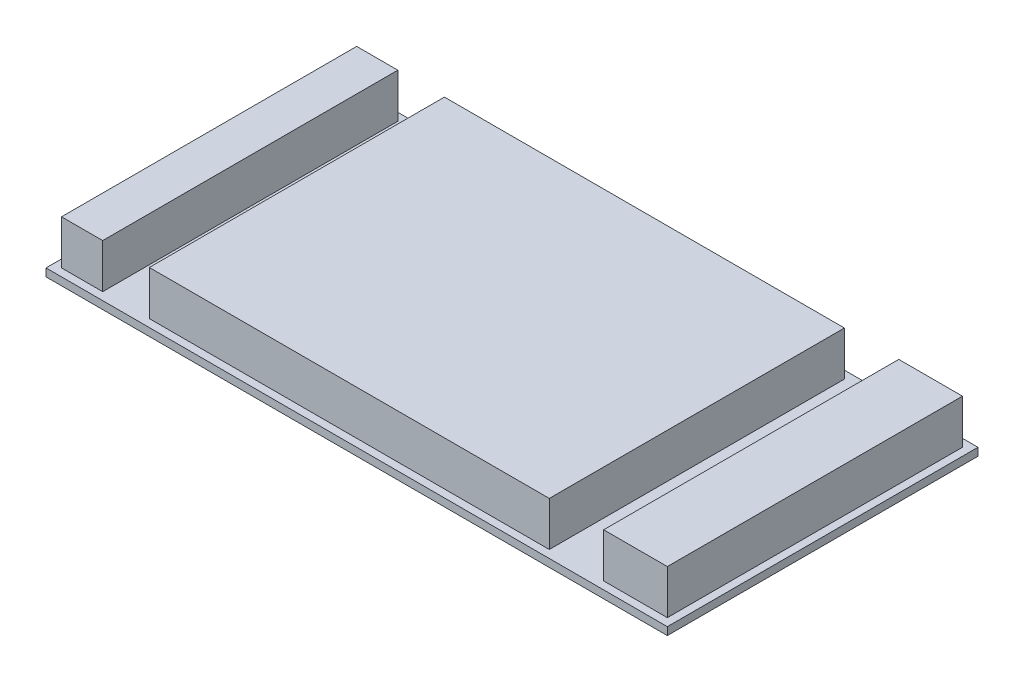
ISO-10303-21;
HEADER;
FILE_DESCRIPTION(('STEP AP214'),'2;1');
FILE_NAME('part.step','',(''),(''),'','','');
FILE_SCHEMA(('AUTOMOTIVE_DESIGN { 1 0 10303 214 1 1 1 1 }'));
ENDSEC;
DATA;
#1=APPLICATION_CONTEXT('core data for automotive mechanical design processes');
#2=APPLICATION_PROTOCOL_DEFINITION('international standard','automotive_design',2000,#1);
#3=PRODUCT_CONTEXT('',#1,'mechanical');
#4=PRODUCT('Part','Part','',(#3));
#5=PRODUCT_RELATED_PRODUCT_CATEGORY('part','',(#4));
#6=PRODUCT_DEFINITION_FORMATION('','',#4);
#7=PRODUCT_DEFINITION_CONTEXT('part definition',#1,'design');
#8=PRODUCT_DEFINITION('design','',#6,#7);
#9=PRODUCT_DEFINITION_SHAPE('','',#8);
#10=(LENGTH_UNIT() NAMED_UNIT(*) SI_UNIT(.MILLI.,.METRE.));
#11=(NAMED_UNIT(*) PLANE_ANGLE_UNIT() SI_UNIT($,.RADIAN.));
#12=(NAMED_UNIT(*) SI_UNIT($,.STERADIAN.) SOLID_ANGLE_UNIT());
#13=UNCERTAINTY_MEASURE_WITH_UNIT(LENGTH_MEASURE(1.E-05),#10,'distance_accuracy_value','');
#14=(GEOMETRIC_REPRESENTATION_CONTEXT(3) GLOBAL_UNCERTAINTY_ASSIGNED_CONTEXT((#13)) GLOBAL_UNIT_ASSIGNED_CONTEXT((#10,
#11,#12)) REPRESENTATION_CONTEXT('',''));
#15=CARTESIAN_POINT('',(0.,0.,0.));
#16=DIRECTION('',(0.,0.,1.));
#17=DIRECTION('',(1.,0.,0.));
#18=AXIS2_PLACEMENT_3D('',#15,#16,#17);
#19=CARTESIAN_POINT('',(80.8789473684211,17.018,-23.1273684210526));
#20=DIRECTION('',(0.,0.,1.));
#21=DIRECTION('',(1.,0.,0.));
#22=AXIS2_PLACEMENT_3D('',#19,#20,#21);
#23=PLANE('',#22);
#24=DIRECTION('',(-1.,0.,0.));
#25=VECTOR('',#24,1.);
#26=CARTESIAN_POINT('',(80.8789473684211,17.018,-23.1273684210526));
#27=LINE('',#26,#25);
#28=CARTESIAN_POINT('',(42.2709473684211,17.018,-23.1273684210526));
#29=VERTEX_POINT('',#28);
#30=CARTESIAN_POINT('',(-88.5390526315789,17.018,-23.1273684210526));
#31=VERTEX_POINT('',#30);
#32=EDGE_CURVE('E175',#29,#31,#27,.T.);
#33=ORIENTED_EDGE('',*,*,#32,.F.);
#34=DIRECTION('',(0.,1.,0.));
#35=VECTOR('',#34,1.);
#36=CARTESIAN_POINT('',(42.2709473684211,17.018,-23.1273684210526));
#37=LINE('',#36,#35);
#38=CARTESIAN_POINT('',(42.2709473684211,2.54,-23.1273684210526));
#39=VERTEX_POINT('',#38);
#40=EDGE_CURVE('E166',#39,#29,#37,.T.);
#41=ORIENTED_EDGE('',*,*,#40,.F.);
#42=DIRECTION('',(-1.,0.,0.));
#43=VECTOR('',#42,1.);
#44=CARTESIAN_POINT('',(80.8789473684211,2.54,-23.1273684210526));
#45=LINE('',#44,#43);
#46=CARTESIAN_POINT('',(-88.5390526315789,2.54,-23.1273684210526));
#47=VERTEX_POINT('',#46);
#48=EDGE_CURVE('E383',#39,#47,#45,.T.);
#49=ORIENTED_EDGE('',*,*,#48,.T.);
#50=DIRECTION('',(0.,-1.,0.));
#51=VECTOR('',#50,1.);
#52=CARTESIAN_POINT('',(-88.5390526315789,17.018,-23.1273684210526));
#53=LINE('',#52,#51);
#54=EDGE_CURVE('E395',#31,#47,#53,.T.);
#55=ORIENTED_EDGE('',*,*,#54,.F.);
#56=EDGE_LOOP('',(#33,#41,#49,#55));
#57=FACE_BOUND('',#56,.T.);
#58=ADVANCED_FACE('F39',(#57),#23,.F.);
#59=CARTESIAN_POINT('',(-103.779052631579,17.018,-23.1273684210526));
#60=VERTEX_POINT('',#59);
#61=CARTESIAN_POINT('',(-117.241052631579,17.018,-23.1273684210526));
#62=VERTEX_POINT('',#61);
#63=EDGE_CURVE('E177',#60,#62,#27,.T.);
#64=ORIENTED_EDGE('',*,*,#63,.F.);
#65=DIRECTION('',(0.,1.,0.));
#66=VECTOR('',#65,1.);
#67=CARTESIAN_POINT('',(-103.779052631579,17.018,-23.1273684210526));
#68=LINE('',#67,#66);
#69=CARTESIAN_POINT('',(-103.779052631579,2.54,-23.1273684210526));
#70=VERTEX_POINT('',#69);
#71=EDGE_CURVE('E270',#70,#60,#68,.T.);
#72=ORIENTED_EDGE('',*,*,#71,.F.);
#73=CARTESIAN_POINT('',(-117.241052631579,2.54,-23.1273684210526));
#74=VERTEX_POINT('',#73);
#75=EDGE_CURVE('E365',#70,#74,#45,.T.);
#76=ORIENTED_EDGE('',*,*,#75,.T.);
#77=DIRECTION('',(0.,-1.,0.));
#78=VECTOR('',#77,1.);
#79=CARTESIAN_POINT('',(-117.241052631579,17.018,-23.1273684210526));
#80=LINE('',#79,#78);
#81=EDGE_CURVE('E214',#62,#74,#80,.T.);
#82=ORIENTED_EDGE('',*,*,#81,.F.);
#83=EDGE_LOOP('',(#64,#72,#76,#82));
#84=FACE_BOUND('',#83,.T.);
#85=ADVANCED_FACE('F305',(#84),#23,.F.);
#86=CARTESIAN_POINT('',(-117.241052631579,17.018,73.3926315789474));
#87=DIRECTION('',(0.,0.,-1.));
#88=DIRECTION('',(-1.,0.,0.));
#89=AXIS2_PLACEMENT_3D('',#86,#87,#88);
#90=PLANE('',#89);
#91=DIRECTION('',(1.,0.,0.));
#92=VECTOR('',#91,1.);
#93=CARTESIAN_POINT('',(-117.241052631579,2.54,73.3926315789474));
#94=LINE('',#93,#92);
#95=CARTESIAN_POINT('',(-88.5390526315789,2.54,73.3926315789474));
#96=VERTEX_POINT('',#95);
#97=CARTESIAN_POINT('',(42.2709473684211,2.54,73.3926315789474));
#98=VERTEX_POINT('',#97);
#99=EDGE_CURVE('E199',#96,#98,#94,.T.);
#100=ORIENTED_EDGE('',*,*,#99,.T.);
#101=DIRECTION('',(0.,1.,0.));
#102=VECTOR('',#101,1.);
#103=CARTESIAN_POINT('',(42.2709473684211,17.018,73.3926315789474));
#104=LINE('',#103,#102);
#105=CARTESIAN_POINT('',(42.2709473684211,17.018,73.3926315789474));
#106=VERTEX_POINT('',#105);
#107=EDGE_CURVE('E377',#98,#106,#104,.T.);
#108=ORIENTED_EDGE('',*,*,#107,.T.);
#109=DIRECTION('',(1.,0.,0.));
#110=VECTOR('',#109,1.);
#111=CARTESIAN_POINT('',(-117.241052631579,17.018,73.3926315789474));
#112=LINE('',#111,#110);
#113=CARTESIAN_POINT('',(-88.5390526315789,17.018,73.3926315789474));
#114=VERTEX_POINT('',#113);
#115=EDGE_CURVE('E281',#114,#106,#112,.T.);
#116=ORIENTED_EDGE('',*,*,#115,.F.);
#117=DIRECTION('',(0.,-1.,0.));
#118=VECTOR('',#117,1.);
#119=CARTESIAN_POINT('',(-88.5390526315789,17.018,73.3926315789474));
#120=LINE('',#119,#118);
#121=EDGE_CURVE('E63',#114,#96,#120,.T.);
#122=ORIENTED_EDGE('',*,*,#121,.T.);
#123=EDGE_LOOP('',(#100,#108,#116,#122));
#124=FACE_BOUND('',#123,.T.);
#125=ADVANCED_FACE('F303',(#124),#90,.F.);
#126=CARTESIAN_POINT('',(-117.241052631579,2.54,73.3926315789474));
#127=VERTEX_POINT('',#126);
#128=CARTESIAN_POINT('',(-103.779052631579,2.54,73.3926315789474));
#129=VERTEX_POINT('',#128);
#130=EDGE_CURVE('E192',#127,#129,#94,.T.);
#131=ORIENTED_EDGE('',*,*,#130,.T.);
#132=DIRECTION('',(0.,1.,0.));
#133=VECTOR('',#132,1.);
#134=CARTESIAN_POINT('',(-103.779052631579,17.018,73.3926315789474));
#135=LINE('',#134,#133);
#136=CARTESIAN_POINT('',(-103.779052631579,17.018,73.3926315789474));
#137=VERTEX_POINT('',#136);
#138=EDGE_CURVE('E267',#129,#137,#135,.T.);
#139=ORIENTED_EDGE('',*,*,#138,.T.);
#140=CARTESIAN_POINT('',(-117.241052631579,17.018,73.3926315789474));
#141=VERTEX_POINT('',#140);
#142=EDGE_CURVE('E275',#141,#137,#112,.T.);
#143=ORIENTED_EDGE('',*,*,#142,.F.);
#144=DIRECTION('',(0.,-1.,0.));
#145=VECTOR('',#144,1.);
#146=CARTESIAN_POINT('',(-117.241052631579,17.018,73.3926315789474));
#147=LINE('',#146,#145);
#148=EDGE_CURVE('E210',#141,#127,#147,.T.);
#149=ORIENTED_EDGE('',*,*,#148,.T.);
#150=EDGE_LOOP('',(#131,#139,#143,#149));
#151=FACE_BOUND('',#150,.T.);
#152=ADVANCED_FACE('F274',(#151),#90,.F.);
#153=CARTESIAN_POINT('',(0.,17.018,0.));
#154=DIRECTION('',(0.,1.,0.));
#155=DIRECTION('',(0.,0.,1.));
#156=AXIS2_PLACEMENT_3D('',#153,#154,#155);
#157=PLANE('',#156);
#158=DIRECTION('',(0.,0.,1.));
#159=VECTOR('',#158,1.);
#160=CARTESIAN_POINT('',(42.2709473684211,17.018,0.));
#161=LINE('',#160,#159);
#162=EDGE_CURVE('E11',#29,#106,#161,.T.);
#163=ORIENTED_EDGE('',*,*,#162,.F.);
#164=ORIENTED_EDGE('',*,*,#32,.T.);
#165=DIRECTION('',(0.,0.,-1.));
#166=VECTOR('',#165,1.);
#167=CARTESIAN_POINT('',(-88.5390526315789,17.018,0.));
#168=LINE('',#167,#166);
#169=EDGE_CURVE('E260',#114,#31,#168,.T.);
#170=ORIENTED_EDGE('',*,*,#169,.F.);
#171=ORIENTED_EDGE('',*,*,#115,.T.);
#172=EDGE_LOOP('',(#163,#164,#170,#171));
#173=FACE_BOUND('',#172,.T.);
#174=ADVANCED_FACE('F300',(#173),#157,.T.);
#175=DIRECTION('',(0.,0.,1.));
#176=VECTOR('',#175,1.);
#177=CARTESIAN_POINT('',(-103.779052631579,17.018,0.));
#178=LINE('',#177,#176);
#179=EDGE_CURVE('E158',#60,#137,#178,.T.);
#180=ORIENTED_EDGE('',*,*,#179,.F.);
#181=ORIENTED_EDGE('',*,*,#63,.T.);
#182=DIRECTION('',(0.,0.,1.));
#183=VECTOR('',#182,1.);
#184=CARTESIAN_POINT('',(-117.241052631579,17.018,-23.1273684210526));
#185=LINE('',#184,#183);
#186=EDGE_CURVE('E174',#62,#141,#185,.T.);
#187=ORIENTED_EDGE('',*,*,#186,.T.);
#188=ORIENTED_EDGE('',*,*,#142,.T.);
#189=EDGE_LOOP('',(#180,#181,#187,#188));
#190=FACE_BOUND('',#189,.T.);
#191=ADVANCED_FACE('F278',(#190),#157,.T.);
#192=CARTESIAN_POINT('',(-119.781052631579,2.54,-25.6673684210526));
#193=DIRECTION('',(1.,0.,0.));
#194=DIRECTION('',(0.,0.,-1.));
#195=AXIS2_PLACEMENT_3D('',#192,#193,#194);
#196=PLANE('',#195);
#197=DIRECTION('',(0.,0.,1.));
#198=VECTOR('',#197,1.);
#199=CARTESIAN_POINT('',(-119.781052631579,0.,-25.6673684210526));
#200=LINE('',#199,#198);
#201=CARTESIAN_POINT('',(-119.781052631579,0.,-25.6673684210526));
#202=VERTEX_POINT('',#201);
#203=CARTESIAN_POINT('',(-119.781052631579,0.,75.9326315789474));
#204=VERTEX_POINT('',#203);
#205=EDGE_CURVE('E218',#202,#204,#200,.T.);
#206=ORIENTED_EDGE('',*,*,#205,.T.);
#207=DIRECTION('',(0.,-1.,0.));
#208=VECTOR('',#207,1.);
#209=CARTESIAN_POINT('',(-119.781052631579,2.54,75.9326315789474));
#210=LINE('',#209,#208);
#211=CARTESIAN_POINT('',(-119.781052631579,2.54,75.9326315789474));
#212=VERTEX_POINT('',#211);
#213=EDGE_CURVE('E256',#212,#204,#210,.T.);
#214=ORIENTED_EDGE('',*,*,#213,.F.);
#215=DIRECTION('',(0.,0.,1.));
#216=VECTOR('',#215,1.);
#217=CARTESIAN_POINT('',(-119.781052631579,2.54,-25.6673684210526));
#218=LINE('',#217,#216);
#219=CARTESIAN_POINT('',(-119.781052631579,2.54,-25.6673684210526));
#220=VERTEX_POINT('',#219);
#221=EDGE_CURVE('E219',#220,#212,#218,.T.);
#222=ORIENTED_EDGE('',*,*,#221,.F.);
#223=DIRECTION('',(0.,-1.,0.));
#224=VECTOR('',#223,1.);
#225=CARTESIAN_POINT('',(-119.781052631579,2.54,-25.6673684210526));
#226=LINE('',#225,#224);
#227=EDGE_CURVE('E233',#220,#202,#226,.T.);
#228=ORIENTED_EDGE('',*,*,#227,.T.);
#229=EDGE_LOOP('',(#206,#214,#222,#228));
#230=FACE_BOUND('',#229,.T.);
#231=ADVANCED_FACE('F41',(#230),#196,.F.);
#232=CARTESIAN_POINT('',(-119.781052631579,2.54,75.9326315789474));
#233=DIRECTION('',(0.,0.,-1.));
#234=DIRECTION('',(-1.,0.,0.));
#235=AXIS2_PLACEMENT_3D('',#232,#233,#234);
#236=PLANE('',#235);
#237=DIRECTION('',(1.,0.,0.));
#238=VECTOR('',#237,1.);
#239=CARTESIAN_POINT('',(-119.781052631579,0.,75.9326315789474));
#240=LINE('',#239,#238);
#241=CARTESIAN_POINT('',(83.4189473684211,0.,75.9326315789474));
#242=VERTEX_POINT('',#241);
#243=EDGE_CURVE('E237',#204,#242,#240,.T.);
#244=ORIENTED_EDGE('',*,*,#243,.T.);
#245=DIRECTION('',(0.,-1.,0.));
#246=VECTOR('',#245,1.);
#247=CARTESIAN_POINT('',(83.4189473684211,2.54,75.9326315789474));
#248=LINE('',#247,#246);
#249=CARTESIAN_POINT('',(83.4189473684211,2.54,75.9326315789474));
#250=VERTEX_POINT('',#249);
#251=EDGE_CURVE('E252',#250,#242,#248,.T.);
#252=ORIENTED_EDGE('',*,*,#251,.F.);
#253=DIRECTION('',(1.,0.,0.));
#254=VECTOR('',#253,1.);
#255=CARTESIAN_POINT('',(-119.781052631579,2.54,75.9326315789474));
#256=LINE('',#255,#254);
#257=EDGE_CURVE('E223',#212,#250,#256,.T.);
#258=ORIENTED_EDGE('',*,*,#257,.F.);
#259=ORIENTED_EDGE('',*,*,#213,.T.);
#260=EDGE_LOOP('',(#244,#252,#258,#259));
#261=FACE_BOUND('',#260,.T.);
#262=ADVANCED_FACE('F337',(#261),#236,.F.);
#263=CARTESIAN_POINT('',(83.4189473684211,2.54,-25.6673684210526));
#264=DIRECTION('',(-1.,0.,0.));
#265=DIRECTION('',(0.,0.,1.));
#266=AXIS2_PLACEMENT_3D('',#263,#264,#265);
#267=PLANE('',#266);
#268=DIRECTION('',(0.,0.,-1.));
#269=VECTOR('',#268,1.);
#270=CARTESIAN_POINT('',(83.4189473684211,0.,-25.6673684210526));
#271=LINE('',#270,#269);
#272=CARTESIAN_POINT('',(83.4189473684211,0.,-25.6673684210526));
#273=VERTEX_POINT('',#272);
#274=EDGE_CURVE('E240',#242,#273,#271,.T.);
#275=ORIENTED_EDGE('',*,*,#274,.T.);
#276=DIRECTION('',(0.,-1.,0.));
#277=VECTOR('',#276,1.);
#278=CARTESIAN_POINT('',(83.4189473684211,2.54,-25.6673684210526));
#279=LINE('',#278,#277);
#280=CARTESIAN_POINT('',(83.4189473684211,2.54,-25.6673684210526));
#281=VERTEX_POINT('',#280);
#282=EDGE_CURVE('E248',#281,#273,#279,.T.);
#283=ORIENTED_EDGE('',*,*,#282,.F.);
#284=DIRECTION('',(0.,0.,-1.));
#285=VECTOR('',#284,1.);
#286=CARTESIAN_POINT('',(83.4189473684211,2.54,-25.6673684210526));
#287=LINE('',#286,#285);
#288=EDGE_CURVE('E227',#250,#281,#287,.T.);
#289=ORIENTED_EDGE('',*,*,#288,.F.);
#290=ORIENTED_EDGE('',*,*,#251,.T.);
#291=EDGE_LOOP('',(#275,#283,#289,#290));
#292=FACE_BOUND('',#291,.T.);
#293=ADVANCED_FACE('F334',(#292),#267,.F.);
#294=CARTESIAN_POINT('',(-119.781052631579,2.54,-25.6673684210526));
#295=DIRECTION('',(0.,0.,1.));
#296=DIRECTION('',(1.,0.,0.));
#297=AXIS2_PLACEMENT_3D('',#294,#295,#296);
#298=PLANE('',#297);
#299=DIRECTION('',(-1.,0.,0.));
#300=VECTOR('',#299,1.);
#301=CARTESIAN_POINT('',(-119.781052631579,0.,-25.6673684210526));
#302=LINE('',#301,#300);
#303=EDGE_CURVE('E224',#273,#202,#302,.T.);
#304=ORIENTED_EDGE('',*,*,#303,.T.);
#305=ORIENTED_EDGE('',*,*,#227,.F.);
#306=DIRECTION('',(-1.,0.,0.));
#307=VECTOR('',#306,1.);
#308=CARTESIAN_POINT('',(-119.781052631579,2.54,-25.6673684210526));
#309=LINE('',#308,#307);
#310=EDGE_CURVE('E230',#281,#220,#309,.T.);
#311=ORIENTED_EDGE('',*,*,#310,.F.);
#312=ORIENTED_EDGE('',*,*,#282,.T.);
#313=EDGE_LOOP('',(#304,#305,#311,#312));
#314=FACE_BOUND('',#313,.T.);
#315=ADVANCED_FACE('F328',(#314),#298,.F.);
#316=CARTESIAN_POINT('',(0.,2.54,0.));
#317=DIRECTION('',(0.,1.,0.));
#318=DIRECTION('',(0.,0.,1.));
#319=AXIS2_PLACEMENT_3D('',#316,#317,#318);
#320=PLANE('',#319);
#321=ORIENTED_EDGE('',*,*,#257,.T.);
#322=ORIENTED_EDGE('',*,*,#288,.T.);
#323=ORIENTED_EDGE('',*,*,#310,.T.);
#324=ORIENTED_EDGE('',*,*,#221,.T.);
#325=EDGE_LOOP('',(#321,#322,#323,#324));
#326=FACE_BOUND('',#325,.T.);
#327=CARTESIAN_POINT('',(60.0509473684211,2.54,73.3926315789474));
#328=VERTEX_POINT('',#327);
#329=CARTESIAN_POINT('',(80.8789473684211,2.54,73.3926315789474));
#330=VERTEX_POINT('',#329);
#331=EDGE_CURVE('E201',#328,#330,#94,.T.);
#332=ORIENTED_EDGE('',*,*,#331,.F.);
#333=DIRECTION('',(0.,0.,-1.));
#334=VECTOR('',#333,1.);
#335=CARTESIAN_POINT('',(60.0509473684211,2.54,78.4726315789474));
#336=LINE('',#335,#334);
#337=CARTESIAN_POINT('',(60.0509473684211,2.54,-23.1273684210526));
#338=VERTEX_POINT('',#337);
#339=EDGE_CURVE('E402',#328,#338,#336,.T.);
#340=ORIENTED_EDGE('',*,*,#339,.T.);
#341=CARTESIAN_POINT('',(80.8789473684211,2.54,-23.1273684210526));
#342=VERTEX_POINT('',#341);
#343=EDGE_CURVE('E164',#342,#338,#45,.T.);
#344=ORIENTED_EDGE('',*,*,#343,.F.);
#345=DIRECTION('',(0.,0.,-1.));
#346=VECTOR('',#345,1.);
#347=CARTESIAN_POINT('',(80.8789473684211,2.54,73.3926315789474));
#348=LINE('',#347,#346);
#349=EDGE_CURVE('E185',#330,#342,#348,.T.);
#350=ORIENTED_EDGE('',*,*,#349,.F.);
#351=EDGE_LOOP('',(#332,#340,#344,#350));
#352=FACE_BOUND('',#351,.T.);
#353=DIRECTION('',(0.,0.,-1.));
#354=VECTOR('',#353,1.);
#355=CARTESIAN_POINT('',(42.2709473684211,2.54,78.4726315789474));
#356=LINE('',#355,#354);
#357=EDGE_CURVE('E360',#98,#39,#356,.T.);
#358=ORIENTED_EDGE('',*,*,#357,.F.);
#359=ORIENTED_EDGE('',*,*,#99,.F.);
#360=DIRECTION('',(0.,0.,-1.));
#361=VECTOR('',#360,1.);
#362=CARTESIAN_POINT('',(-88.5390526315789,2.54,78.4726315789474));
#363=LINE('',#362,#361);
#364=EDGE_CURVE('E367',#96,#47,#363,.T.);
#365=ORIENTED_EDGE('',*,*,#364,.T.);
#366=ORIENTED_EDGE('',*,*,#48,.F.);
#367=EDGE_LOOP('',(#358,#359,#365,#366));
#368=FACE_BOUND('',#367,.T.);
#369=DIRECTION('',(0.,0.,-1.));
#370=VECTOR('',#369,1.);
#371=CARTESIAN_POINT('',(-103.779052631579,2.54,78.4726315789474));
#372=LINE('',#371,#370);
#373=EDGE_CURVE('E167',#129,#70,#372,.T.);
#374=ORIENTED_EDGE('',*,*,#373,.F.);
#375=ORIENTED_EDGE('',*,*,#130,.F.);
#376=DIRECTION('',(0.,0.,1.));
#377=VECTOR('',#376,1.);
#378=CARTESIAN_POINT('',(-117.241052631579,2.54,-23.1273684210526));
#379=LINE('',#378,#377);
#380=EDGE_CURVE('E389',#74,#127,#379,.T.);
#381=ORIENTED_EDGE('',*,*,#380,.F.);
#382=ORIENTED_EDGE('',*,*,#75,.F.);
#383=EDGE_LOOP('',(#374,#375,#381,#382));
#384=FACE_BOUND('',#383,.T.);
#385=ADVANCED_FACE('F322',(#326,#352,#368,#384),#320,.T.);
#386=CARTESIAN_POINT('',(0.,0.,0.));
#387=DIRECTION('',(0.,1.,0.));
#388=DIRECTION('',(0.,0.,1.));
#389=AXIS2_PLACEMENT_3D('',#386,#387,#388);
#390=PLANE('',#389);
#391=ORIENTED_EDGE('',*,*,#205,.F.);
#392=ORIENTED_EDGE('',*,*,#303,.F.);
#393=ORIENTED_EDGE('',*,*,#274,.F.);
#394=ORIENTED_EDGE('',*,*,#243,.F.);
#395=EDGE_LOOP('',(#391,#392,#393,#394));
#396=FACE_BOUND('',#395,.T.);
#397=ADVANCED_FACE('F316',(#396),#390,.F.);
#398=ORIENTED_EDGE('',*,*,#343,.T.);
#399=DIRECTION('',(0.,-1.,0.));
#400=VECTOR('',#399,1.);
#401=CARTESIAN_POINT('',(60.0509473684211,17.018,-23.1273684210526));
#402=LINE('',#401,#400);
#403=CARTESIAN_POINT('',(60.0509473684211,17.018,-23.1273684210526));
#404=VERTEX_POINT('',#403);
#405=EDGE_CURVE('E152',#404,#338,#402,.T.);
#406=ORIENTED_EDGE('',*,*,#405,.F.);
#407=CARTESIAN_POINT('',(80.8789473684211,17.018,-23.1273684210526));
#408=VERTEX_POINT('',#407);
#409=EDGE_CURVE('E163',#408,#404,#27,.T.);
#410=ORIENTED_EDGE('',*,*,#409,.F.);
#411=DIRECTION('',(0.,-1.,0.));
#412=VECTOR('',#411,1.);
#413=CARTESIAN_POINT('',(80.8789473684211,17.018,-23.1273684210526));
#414=LINE('',#413,#412);
#415=EDGE_CURVE('E204',#408,#342,#414,.T.);
#416=ORIENTED_EDGE('',*,*,#415,.T.);
#417=EDGE_LOOP('',(#398,#406,#410,#416));
#418=FACE_BOUND('',#417,.T.);
#419=ADVANCED_FACE('F161',(#418),#23,.F.);
#420=CARTESIAN_POINT('',(-117.241052631579,17.018,-23.1273684210526));
#421=DIRECTION('',(1.,0.,0.));
#422=DIRECTION('',(0.,0.,-1.));
#423=AXIS2_PLACEMENT_3D('',#420,#421,#422);
#424=PLANE('',#423);
#425=ORIENTED_EDGE('',*,*,#380,.T.);
#426=ORIENTED_EDGE('',*,*,#148,.F.);
#427=ORIENTED_EDGE('',*,*,#186,.F.);
#428=ORIENTED_EDGE('',*,*,#81,.T.);
#429=EDGE_LOOP('',(#425,#426,#427,#428));
#430=FACE_BOUND('',#429,.T.);
#431=ADVANCED_FACE('F301',(#430),#424,.F.);
#432=CARTESIAN_POINT('',(60.0509473684211,17.018,73.3926315789474));
#433=VERTEX_POINT('',#432);
#434=CARTESIAN_POINT('',(80.8789473684211,17.018,73.3926315789474));
#435=VERTEX_POINT('',#434);
#436=EDGE_CURVE('E180',#433,#435,#112,.T.);
#437=ORIENTED_EDGE('',*,*,#436,.F.);
#438=DIRECTION('',(0.,-1.,0.));
#439=VECTOR('',#438,1.);
#440=CARTESIAN_POINT('',(60.0509473684211,17.018,73.3926315789474));
#441=LINE('',#440,#439);
#442=EDGE_CURVE('E55',#433,#328,#441,.T.);
#443=ORIENTED_EDGE('',*,*,#442,.T.);
#444=ORIENTED_EDGE('',*,*,#331,.T.);
#445=DIRECTION('',(0.,-1.,0.));
#446=VECTOR('',#445,1.);
#447=CARTESIAN_POINT('',(80.8789473684211,17.018,73.3926315789474));
#448=LINE('',#447,#446);
#449=EDGE_CURVE('E207',#435,#330,#448,.T.);
#450=ORIENTED_EDGE('',*,*,#449,.F.);
#451=EDGE_LOOP('',(#437,#443,#444,#450));
#452=FACE_BOUND('',#451,.T.);
#453=ADVANCED_FACE('F290',(#452),#90,.F.);
#454=CARTESIAN_POINT('',(80.8789473684211,17.018,73.3926315789474));
#455=DIRECTION('',(-1.,0.,0.));
#456=DIRECTION('',(0.,0.,1.));
#457=AXIS2_PLACEMENT_3D('',#454,#455,#456);
#458=PLANE('',#457);
#459=ORIENTED_EDGE('',*,*,#349,.T.);
#460=ORIENTED_EDGE('',*,*,#415,.F.);
#461=DIRECTION('',(0.,0.,-1.));
#462=VECTOR('',#461,1.);
#463=CARTESIAN_POINT('',(80.8789473684211,17.018,73.3926315789474));
#464=LINE('',#463,#462);
#465=EDGE_CURVE('E171',#435,#408,#464,.T.);
#466=ORIENTED_EDGE('',*,*,#465,.F.);
#467=ORIENTED_EDGE('',*,*,#449,.T.);
#468=EDGE_LOOP('',(#459,#460,#466,#467));
#469=FACE_BOUND('',#468,.T.);
#470=ADVANCED_FACE('F292',(#469),#458,.F.);
#471=DIRECTION('',(0.,0.,-1.));
#472=VECTOR('',#471,1.);
#473=CARTESIAN_POINT('',(60.0509473684211,17.018,0.));
#474=LINE('',#473,#472);
#475=EDGE_CURVE('E48',#433,#404,#474,.T.);
#476=ORIENTED_EDGE('',*,*,#475,.F.);
#477=ORIENTED_EDGE('',*,*,#436,.T.);
#478=ORIENTED_EDGE('',*,*,#465,.T.);
#479=ORIENTED_EDGE('',*,*,#409,.T.);
#480=EDGE_LOOP('',(#476,#477,#478,#479));
#481=FACE_BOUND('',#480,.T.);
#482=ADVANCED_FACE('F169',(#481),#157,.T.);
#483=CARTESIAN_POINT('',(-103.779052631579,17.018,78.4726315789474));
#484=DIRECTION('',(-1.,0.,0.));
#485=DIRECTION('',(0.,0.,1.));
#486=AXIS2_PLACEMENT_3D('',#483,#484,#485);
#487=PLANE('',#486);
#488=ORIENTED_EDGE('',*,*,#373,.T.);
#489=ORIENTED_EDGE('',*,*,#71,.T.);
#490=ORIENTED_EDGE('',*,*,#179,.T.);
#491=ORIENTED_EDGE('',*,*,#138,.F.);
#492=EDGE_LOOP('',(#488,#489,#490,#491));
#493=FACE_BOUND('',#492,.T.);
#494=ADVANCED_FACE('F266',(#493),#487,.F.);
#495=CARTESIAN_POINT('',(-88.5390526315789,17.018,78.4726315789474));
#496=DIRECTION('',(1.,0.,0.));
#497=DIRECTION('',(0.,0.,-1.));
#498=AXIS2_PLACEMENT_3D('',#495,#496,#497);
#499=PLANE('',#498);
#500=ORIENTED_EDGE('',*,*,#169,.T.);
#501=ORIENTED_EDGE('',*,*,#54,.T.);
#502=ORIENTED_EDGE('',*,*,#364,.F.);
#503=ORIENTED_EDGE('',*,*,#121,.F.);
#504=EDGE_LOOP('',(#500,#501,#502,#503));
#505=FACE_BOUND('',#504,.T.);
#506=ADVANCED_FACE('F396',(#505),#499,.F.);
#507=CARTESIAN_POINT('',(42.2709473684211,17.018,78.4726315789474));
#508=DIRECTION('',(-1.,0.,0.));
#509=DIRECTION('',(0.,0.,1.));
#510=AXIS2_PLACEMENT_3D('',#507,#508,#509);
#511=PLANE('',#510);
#512=ORIENTED_EDGE('',*,*,#357,.T.);
#513=ORIENTED_EDGE('',*,*,#40,.T.);
#514=ORIENTED_EDGE('',*,*,#162,.T.);
#515=ORIENTED_EDGE('',*,*,#107,.F.);
#516=EDGE_LOOP('',(#512,#513,#514,#515));
#517=FACE_BOUND('',#516,.T.);
#518=ADVANCED_FACE('F408',(#517),#511,.F.);
#519=CARTESIAN_POINT('',(60.0509473684211,17.018,78.4726315789474));
#520=DIRECTION('',(1.,0.,0.));
#521=DIRECTION('',(0.,0.,-1.));
#522=AXIS2_PLACEMENT_3D('',#519,#520,#521);
#523=PLANE('',#522);
#524=ORIENTED_EDGE('',*,*,#475,.T.);
#525=ORIENTED_EDGE('',*,*,#405,.T.);
#526=ORIENTED_EDGE('',*,*,#339,.F.);
#527=ORIENTED_EDGE('',*,*,#442,.F.);
#528=EDGE_LOOP('',(#524,#525,#526,#527));
#529=FACE_BOUND('',#528,.T.);
#530=ADVANCED_FACE('F151',(#529),#523,.F.);
#531=CLOSED_SHELL('',(#58,#85,#125,#152,#174,#191,#231,#262,#293,#315,#385,#397,#419,#431,#453,
#470,#482,#494,#506,#518,#530));
#532=MANIFOLD_SOLID_BREP('B2',#531);
#533=ADVANCED_BREP_SHAPE_REPRESENTATION('',(#18,#532),#14);
#534=SHAPE_DEFINITION_REPRESENTATION(#9,#533);
ENDSEC;
END-ISO-10303-21;
